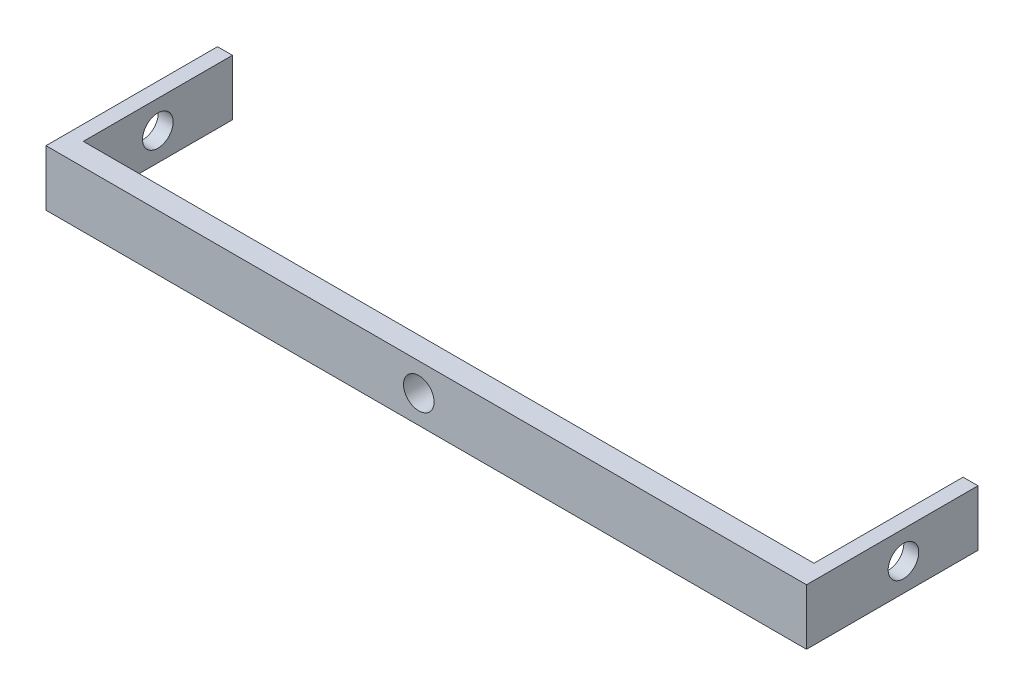
ISO-10303-21;
HEADER;
FILE_DESCRIPTION(('STEP AP214'),'2;1');
FILE_NAME('part.step','',(''),(''),'','','');
FILE_SCHEMA(('AUTOMOTIVE_DESIGN { 1 0 10303 214 1 1 1 1 }'));
ENDSEC;
DATA;
#1=APPLICATION_CONTEXT('core data for automotive mechanical design processes');
#2=APPLICATION_PROTOCOL_DEFINITION('international standard','automotive_design',2000,#1);
#3=PRODUCT_CONTEXT('',#1,'mechanical');
#4=PRODUCT('Part','Part','',(#3));
#5=PRODUCT_RELATED_PRODUCT_CATEGORY('part','',(#4));
#6=PRODUCT_DEFINITION_FORMATION('','',#4);
#7=PRODUCT_DEFINITION_CONTEXT('part definition',#1,'design');
#8=PRODUCT_DEFINITION('design','',#6,#7);
#9=PRODUCT_DEFINITION_SHAPE('','',#8);
#10=(LENGTH_UNIT() NAMED_UNIT(*) SI_UNIT(.MILLI.,.METRE.));
#11=(NAMED_UNIT(*) PLANE_ANGLE_UNIT() SI_UNIT($,.RADIAN.));
#12=(NAMED_UNIT(*) SI_UNIT($,.STERADIAN.) SOLID_ANGLE_UNIT());
#13=UNCERTAINTY_MEASURE_WITH_UNIT(LENGTH_MEASURE(1.E-05),#10,'distance_accuracy_value','');
#14=(GEOMETRIC_REPRESENTATION_CONTEXT(3) GLOBAL_UNCERTAINTY_ASSIGNED_CONTEXT((#13)) GLOBAL_UNIT_ASSIGNED_CONTEXT((#10,
#11,#12)) REPRESENTATION_CONTEXT('',''));
#15=CARTESIAN_POINT('',(0.,0.,0.));
#16=DIRECTION('',(0.,0.,1.));
#17=DIRECTION('',(1.,0.,0.));
#18=AXIS2_PLACEMENT_3D('',#15,#16,#17);
#19=CARTESIAN_POINT('',(-50.,-3.75000000000001,3.));
#20=DIRECTION('',(1.,0.,0.));
#21=DIRECTION('',(0.,0.,-1.));
#22=AXIS2_PLACEMENT_3D('',#19,#20,#21);
#23=PLANE('',#22);
#24=CARTESIAN_POINT('',(-50.,0.,-10.));
#25=DIRECTION('',(1.,0.,0.));
#26=DIRECTION('',(0.,0.,-1.));
#27=AXIS2_PLACEMENT_3D('',#24,#25,#26);
#28=CIRCLE('',#27,2.05000000000831);
#29=CARTESIAN_POINT('',(-50.,0.,-12.0500000000083));
#30=VERTEX_POINT('',#29);
#31=EDGE_CURVE('E207',#30,#30,#28,.T.);
#32=ORIENTED_EDGE('',*,*,#31,.T.);
#33=EDGE_LOOP('',(#32));
#34=FACE_BOUND('',#33,.T.);
#35=DIRECTION('',(0.,0.,-1.));
#36=VECTOR('',#35,1.);
#37=CARTESIAN_POINT('',(-50.,3.74999999999999,3.));
#38=LINE('',#37,#36);
#39=CARTESIAN_POINT('',(-50.,3.74999999999999,3.));
#40=VERTEX_POINT('',#39);
#41=CARTESIAN_POINT('',(-50.,3.75,-20.));
#42=VERTEX_POINT('',#41);
#43=EDGE_CURVE('E183',#40,#42,#38,.T.);
#44=ORIENTED_EDGE('',*,*,#43,.T.);
#45=DIRECTION('',(0.,1.,0.));
#46=VECTOR('',#45,1.);
#47=CARTESIAN_POINT('',(-50.,-3.75000000000001,-20.));
#48=LINE('',#47,#46);
#49=CARTESIAN_POINT('',(-50.,-3.75,-20.));
#50=VERTEX_POINT('',#49);
#51=EDGE_CURVE('E138',#50,#42,#48,.T.);
#52=ORIENTED_EDGE('',*,*,#51,.F.);
#53=DIRECTION('',(0.,0.,-1.));
#54=VECTOR('',#53,1.);
#55=CARTESIAN_POINT('',(-50.,-3.75000000000001,3.));
#56=LINE('',#55,#54);
#57=CARTESIAN_POINT('',(-50.,-3.75000000000001,3.));
#58=VERTEX_POINT('',#57);
#59=EDGE_CURVE('E53',#58,#50,#56,.T.);
#60=ORIENTED_EDGE('',*,*,#59,.F.);
#61=DIRECTION('',(0.,-1.,0.));
#62=VECTOR('',#61,1.);
#63=CARTESIAN_POINT('',(-50.,-3.75000000000001,3.));
#64=LINE('',#63,#62);
#65=EDGE_CURVE('E174',#40,#58,#64,.T.);
#66=ORIENTED_EDGE('',*,*,#65,.F.);
#67=EDGE_LOOP('',(#44,#52,#60,#66));
#68=FACE_BOUND('',#67,.T.);
#69=ADVANCED_FACE('F43',(#34,#68),#23,.F.);
#70=CARTESIAN_POINT('',(50.,-3.74999999999999,3.));
#71=DIRECTION('',(0.,1.,0.));
#72=DIRECTION('',(-1.,0.,0.));
#73=AXIS2_PLACEMENT_3D('',#70,#71,#72);
#74=PLANE('',#73);
#75=DIRECTION('',(0.,0.,-1.));
#76=VECTOR('',#75,1.);
#77=CARTESIAN_POINT('',(52.,-3.75,3.));
#78=LINE('',#77,#76);
#79=CARTESIAN_POINT('',(52.,-3.75,3.));
#80=VERTEX_POINT('',#79);
#81=CARTESIAN_POINT('',(52.,-3.75,-20.));
#82=VERTEX_POINT('',#81);
#83=EDGE_CURVE('E151',#80,#82,#78,.T.);
#84=ORIENTED_EDGE('',*,*,#83,.F.);
#85=DIRECTION('',(1.,0.,0.));
#86=VECTOR('',#85,1.);
#87=CARTESIAN_POINT('',(50.,-3.74999999999999,3.));
#88=LINE('',#87,#86);
#89=EDGE_CURVE('E177',#58,#80,#88,.T.);
#90=ORIENTED_EDGE('',*,*,#89,.F.);
#91=ORIENTED_EDGE('',*,*,#59,.T.);
#92=DIRECTION('',(-1.,0.,0.));
#93=VECTOR('',#92,1.);
#94=CARTESIAN_POINT('',(-48.,-3.75,-20.));
#95=LINE('',#94,#93);
#96=CARTESIAN_POINT('',(-48.,-3.75,-20.));
#97=VERTEX_POINT('',#96);
#98=EDGE_CURVE('E118',#97,#50,#95,.T.);
#99=ORIENTED_EDGE('',*,*,#98,.F.);
#100=DIRECTION('',(0.,0.,-1.));
#101=VECTOR('',#100,1.);
#102=CARTESIAN_POINT('',(-48.,-3.75,3.));
#103=LINE('',#102,#101);
#104=CARTESIAN_POINT('',(-48.,-3.75,0.));
#105=VERTEX_POINT('',#104);
#106=EDGE_CURVE('E105',#105,#97,#103,.T.);
#107=ORIENTED_EDGE('',*,*,#106,.F.);
#108=DIRECTION('',(1.,0.,0.));
#109=VECTOR('',#108,1.);
#110=CARTESIAN_POINT('',(50.,-3.74999999999999,0.));
#111=LINE('',#110,#109);
#112=CARTESIAN_POINT('',(50.,-3.74999999999999,0.));
#113=VERTEX_POINT('',#112);
#114=EDGE_CURVE('E173',#105,#113,#111,.T.);
#115=ORIENTED_EDGE('',*,*,#114,.T.);
#116=DIRECTION('',(0.,0.,-1.));
#117=VECTOR('',#116,1.);
#118=CARTESIAN_POINT('',(50.,-3.75,3.));
#119=LINE('',#118,#117);
#120=CARTESIAN_POINT('',(50.,-3.75,-20.));
#121=VERTEX_POINT('',#120);
#122=EDGE_CURVE('E161',#113,#121,#119,.T.);
#123=ORIENTED_EDGE('',*,*,#122,.T.);
#124=DIRECTION('',(-1.,0.,0.));
#125=VECTOR('',#124,1.);
#126=CARTESIAN_POINT('',(52.,-3.75,-20.));
#127=LINE('',#126,#125);
#128=EDGE_CURVE('E169',#82,#121,#127,.T.);
#129=ORIENTED_EDGE('',*,*,#128,.F.);
#130=EDGE_LOOP('',(#84,#90,#91,#99,#107,#115,#123,#129));
#131=FACE_BOUND('',#130,.T.);
#132=ADVANCED_FACE('F120',(#131),#74,.F.);
#133=CARTESIAN_POINT('',(50.,3.75000000000001,3.));
#134=DIRECTION('',(0.,-1.,0.));
#135=DIRECTION('',(1.,0.,0.));
#136=AXIS2_PLACEMENT_3D('',#133,#134,#135);
#137=PLANE('',#136);
#138=DIRECTION('',(-1.,0.,0.));
#139=VECTOR('',#138,1.);
#140=CARTESIAN_POINT('',(50.,3.75000000000001,0.));
#141=LINE('',#140,#139);
#142=CARTESIAN_POINT('',(50.,3.75,0.));
#143=VERTEX_POINT('',#142);
#144=CARTESIAN_POINT('',(-48.,3.75,0.));
#145=VERTEX_POINT('',#144);
#146=EDGE_CURVE('E178',#143,#145,#141,.T.);
#147=ORIENTED_EDGE('',*,*,#146,.T.);
#148=DIRECTION('',(0.,0.,1.));
#149=VECTOR('',#148,1.);
#150=CARTESIAN_POINT('',(-48.,3.75,3.));
#151=LINE('',#150,#149);
#152=CARTESIAN_POINT('',(-48.,3.75,-20.));
#153=VERTEX_POINT('',#152);
#154=EDGE_CURVE('E115',#153,#145,#151,.T.);
#155=ORIENTED_EDGE('',*,*,#154,.F.);
#156=DIRECTION('',(-1.,0.,0.));
#157=VECTOR('',#156,1.);
#158=CARTESIAN_POINT('',(-48.,3.75,-20.));
#159=LINE('',#158,#157);
#160=EDGE_CURVE('E127',#153,#42,#159,.T.);
#161=ORIENTED_EDGE('',*,*,#160,.T.);
#162=ORIENTED_EDGE('',*,*,#43,.F.);
#163=DIRECTION('',(-1.,0.,0.));
#164=VECTOR('',#163,1.);
#165=CARTESIAN_POINT('',(50.,3.75000000000001,3.));
#166=LINE('',#165,#164);
#167=CARTESIAN_POINT('',(52.,3.75,3.));
#168=VERTEX_POINT('',#167);
#169=EDGE_CURVE('E61',#168,#40,#166,.T.);
#170=ORIENTED_EDGE('',*,*,#169,.F.);
#171=DIRECTION('',(0.,0.,1.));
#172=VECTOR('',#171,1.);
#173=CARTESIAN_POINT('',(52.,3.75,3.));
#174=LINE('',#173,#172);
#175=CARTESIAN_POINT('',(52.,3.75,-20.));
#176=VERTEX_POINT('',#175);
#177=EDGE_CURVE('E142',#176,#168,#174,.T.);
#178=ORIENTED_EDGE('',*,*,#177,.F.);
#179=DIRECTION('',(-1.,0.,0.));
#180=VECTOR('',#179,1.);
#181=CARTESIAN_POINT('',(52.,3.75,-20.));
#182=LINE('',#181,#180);
#183=CARTESIAN_POINT('',(50.,3.75,-20.));
#184=VERTEX_POINT('',#183);
#185=EDGE_CURVE('E157',#176,#184,#182,.T.);
#186=ORIENTED_EDGE('',*,*,#185,.T.);
#187=DIRECTION('',(0.,0.,1.));
#188=VECTOR('',#187,1.);
#189=CARTESIAN_POINT('',(50.,3.75,3.));
#190=LINE('',#189,#188);
#191=EDGE_CURVE('E126',#184,#143,#190,.T.);
#192=ORIENTED_EDGE('',*,*,#191,.T.);
#193=EDGE_LOOP('',(#147,#155,#161,#162,#170,#178,#186,#192));
#194=FACE_BOUND('',#193,.T.);
#195=ADVANCED_FACE('F221',(#194),#137,.F.);
#196=CARTESIAN_POINT('',(0.,0.,3.));
#197=DIRECTION('',(0.,0.,1.));
#198=DIRECTION('',(1.,0.,0.));
#199=AXIS2_PLACEMENT_3D('',#196,#197,#198);
#200=PLANE('',#199);
#201=CARTESIAN_POINT('',(0.,0.,3.));
#202=DIRECTION('',(0.,0.,1.));
#203=DIRECTION('',(1.,0.,0.));
#204=AXIS2_PLACEMENT_3D('',#201,#202,#203);
#205=CIRCLE('',#204,2.05);
#206=CARTESIAN_POINT('',(2.05,0.,3.));
#207=VERTEX_POINT('',#206);
#208=EDGE_CURVE('E215',#207,#207,#205,.T.);
#209=ORIENTED_EDGE('',*,*,#208,.F.);
#210=EDGE_LOOP('',(#209));
#211=FACE_BOUND('',#210,.T.);
#212=ORIENTED_EDGE('',*,*,#169,.T.);
#213=ORIENTED_EDGE('',*,*,#65,.T.);
#214=ORIENTED_EDGE('',*,*,#89,.T.);
#215=DIRECTION('',(0.,-1.,0.));
#216=VECTOR('',#215,1.);
#217=CARTESIAN_POINT('',(52.,-3.74999999999999,3.));
#218=LINE('',#217,#216);
#219=EDGE_CURVE('E146',#168,#80,#218,.T.);
#220=ORIENTED_EDGE('',*,*,#219,.F.);
#221=EDGE_LOOP('',(#212,#213,#214,#220));
#222=FACE_BOUND('',#221,.T.);
#223=ADVANCED_FACE('F236',(#211,#222),#200,.T.);
#224=CARTESIAN_POINT('',(0.,0.,0.));
#225=DIRECTION('',(0.,0.,1.));
#226=DIRECTION('',(1.,0.,0.));
#227=AXIS2_PLACEMENT_3D('',#224,#225,#226);
#228=PLANE('',#227);
#229=CARTESIAN_POINT('',(0.,0.,0.));
#230=DIRECTION('',(0.,0.,1.));
#231=DIRECTION('',(1.,0.,0.));
#232=AXIS2_PLACEMENT_3D('',#229,#230,#231);
#233=CIRCLE('',#232,2.05);
#234=CARTESIAN_POINT('',(2.05,0.,0.));
#235=VERTEX_POINT('',#234);
#236=EDGE_CURVE('E46',#235,#235,#233,.T.);
#237=ORIENTED_EDGE('',*,*,#236,.T.);
#238=EDGE_LOOP('',(#237));
#239=FACE_BOUND('',#238,.T.);
#240=ORIENTED_EDGE('',*,*,#114,.F.);
#241=DIRECTION('',(0.,1.,0.));
#242=VECTOR('',#241,1.);
#243=CARTESIAN_POINT('',(-48.,0.,0.));
#244=LINE('',#243,#242);
#245=EDGE_CURVE('E11',#105,#145,#244,.T.);
#246=ORIENTED_EDGE('',*,*,#245,.T.);
#247=ORIENTED_EDGE('',*,*,#146,.F.);
#248=DIRECTION('',(0.,1.,0.));
#249=VECTOR('',#248,1.);
#250=CARTESIAN_POINT('',(50.,-3.74999999999999,0.));
#251=LINE('',#250,#249);
#252=EDGE_CURVE('E186',#113,#143,#251,.T.);
#253=ORIENTED_EDGE('',*,*,#252,.F.);
#254=EDGE_LOOP('',(#240,#246,#247,#253));
#255=FACE_BOUND('',#254,.T.);
#256=ADVANCED_FACE('F219',(#239,#255),#228,.F.);
#257=CARTESIAN_POINT('',(50.,0.,0.));
#258=DIRECTION('',(1.,0.,0.));
#259=DIRECTION('',(0.,0.,-1.));
#260=AXIS2_PLACEMENT_3D('',#257,#258,#259);
#261=PLANE('',#260);
#262=CARTESIAN_POINT('',(50.,0.,-10.));
#263=DIRECTION('',(1.,0.,0.));
#264=DIRECTION('',(0.,0.,-1.));
#265=AXIS2_PLACEMENT_3D('',#262,#263,#264);
#266=CIRCLE('',#265,2.05000000000831);
#267=CARTESIAN_POINT('',(50.,0.,-12.0500000000083));
#268=VERTEX_POINT('',#267);
#269=EDGE_CURVE('E140',#268,#268,#266,.F.);
#270=ORIENTED_EDGE('',*,*,#269,.F.);
#271=EDGE_LOOP('',(#270));
#272=FACE_BOUND('',#271,.T.);
#273=ORIENTED_EDGE('',*,*,#122,.F.);
#274=ORIENTED_EDGE('',*,*,#252,.T.);
#275=ORIENTED_EDGE('',*,*,#191,.F.);
#276=DIRECTION('',(0.,1.,0.));
#277=VECTOR('',#276,1.);
#278=CARTESIAN_POINT('',(50.,-3.74999999999999,-20.));
#279=LINE('',#278,#277);
#280=EDGE_CURVE('E147',#121,#184,#279,.T.);
#281=ORIENTED_EDGE('',*,*,#280,.F.);
#282=EDGE_LOOP('',(#273,#274,#275,#281));
#283=FACE_BOUND('',#282,.T.);
#284=ADVANCED_FACE('F228',(#272,#283),#261,.F.);
#285=CARTESIAN_POINT('',(52.,-3.74999999999999,-20.));
#286=DIRECTION('',(0.,0.,1.));
#287=DIRECTION('',(1.,0.,0.));
#288=AXIS2_PLACEMENT_3D('',#285,#286,#287);
#289=PLANE('',#288);
#290=ORIENTED_EDGE('',*,*,#280,.T.);
#291=ORIENTED_EDGE('',*,*,#185,.F.);
#292=DIRECTION('',(0.,1.,0.));
#293=VECTOR('',#292,1.);
#294=CARTESIAN_POINT('',(52.,-3.74999999999999,-20.));
#295=LINE('',#294,#293);
#296=EDGE_CURVE('E154',#82,#176,#295,.T.);
#297=ORIENTED_EDGE('',*,*,#296,.F.);
#298=ORIENTED_EDGE('',*,*,#128,.T.);
#299=EDGE_LOOP('',(#290,#291,#297,#298));
#300=FACE_BOUND('',#299,.T.);
#301=ADVANCED_FACE('F232',(#300),#289,.F.);
#302=CARTESIAN_POINT('',(52.,0.,0.));
#303=DIRECTION('',(1.,0.,0.));
#304=DIRECTION('',(0.,0.,-1.));
#305=AXIS2_PLACEMENT_3D('',#302,#303,#304);
#306=PLANE('',#305);
#307=CARTESIAN_POINT('',(52.,0.,-10.));
#308=DIRECTION('',(1.,0.,0.));
#309=DIRECTION('',(0.,0.,-1.));
#310=AXIS2_PLACEMENT_3D('',#307,#308,#309);
#311=CIRCLE('',#310,2.05000000000831);
#312=CARTESIAN_POINT('',(52.,0.,-12.0500000000083));
#313=VERTEX_POINT('',#312);
#314=EDGE_CURVE('E199',#313,#313,#311,.T.);
#315=ORIENTED_EDGE('',*,*,#314,.F.);
#316=EDGE_LOOP('',(#315));
#317=FACE_BOUND('',#316,.T.);
#318=ORIENTED_EDGE('',*,*,#177,.T.);
#319=ORIENTED_EDGE('',*,*,#219,.T.);
#320=ORIENTED_EDGE('',*,*,#83,.T.);
#321=ORIENTED_EDGE('',*,*,#296,.T.);
#322=EDGE_LOOP('',(#318,#319,#320,#321));
#323=FACE_BOUND('',#322,.T.);
#324=ADVANCED_FACE('F234',(#317,#323),#306,.T.);
#325=CARTESIAN_POINT('',(-48.,0.,0.));
#326=DIRECTION('',(1.,0.,0.));
#327=DIRECTION('',(0.,0.,-1.));
#328=AXIS2_PLACEMENT_3D('',#325,#326,#327);
#329=PLANE('',#328);
#330=CARTESIAN_POINT('',(-48.,0.,-10.));
#331=DIRECTION('',(1.,0.,0.));
#332=DIRECTION('',(0.,0.,-1.));
#333=AXIS2_PLACEMENT_3D('',#330,#331,#332);
#334=CIRCLE('',#333,2.05000000000831);
#335=CARTESIAN_POINT('',(-48.,0.,-12.0500000000083));
#336=VERTEX_POINT('',#335);
#337=EDGE_CURVE('E196',#336,#336,#334,.F.);
#338=ORIENTED_EDGE('',*,*,#337,.T.);
#339=EDGE_LOOP('',(#338));
#340=FACE_BOUND('',#339,.T.);
#341=ORIENTED_EDGE('',*,*,#245,.F.);
#342=ORIENTED_EDGE('',*,*,#106,.T.);
#343=DIRECTION('',(0.,1.,0.));
#344=VECTOR('',#343,1.);
#345=CARTESIAN_POINT('',(-48.,-3.75000000000001,-20.));
#346=LINE('',#345,#344);
#347=EDGE_CURVE('E109',#97,#153,#346,.T.);
#348=ORIENTED_EDGE('',*,*,#347,.T.);
#349=ORIENTED_EDGE('',*,*,#154,.T.);
#350=EDGE_LOOP('',(#341,#342,#348,#349));
#351=FACE_BOUND('',#350,.T.);
#352=ADVANCED_FACE('F107',(#340,#351),#329,.T.);
#353=CARTESIAN_POINT('',(-48.,-3.75000000000001,-20.));
#354=DIRECTION('',(0.,0.,1.));
#355=DIRECTION('',(1.,0.,0.));
#356=AXIS2_PLACEMENT_3D('',#353,#354,#355);
#357=PLANE('',#356);
#358=ORIENTED_EDGE('',*,*,#51,.T.);
#359=ORIENTED_EDGE('',*,*,#160,.F.);
#360=ORIENTED_EDGE('',*,*,#347,.F.);
#361=ORIENTED_EDGE('',*,*,#98,.T.);
#362=EDGE_LOOP('',(#358,#359,#360,#361));
#363=FACE_BOUND('',#362,.T.);
#364=ADVANCED_FACE('F129',(#363),#357,.F.);
#365=CARTESIAN_POINT('',(52.,0.,-10.));
#366=DIRECTION('',(-1.,0.,0.));
#367=DIRECTION('',(0.,0.,1.));
#368=AXIS2_PLACEMENT_3D('',#365,#366,#367);
#369=CYLINDRICAL_SURFACE('',#368,2.05000000000831);
#370=ORIENTED_EDGE('',*,*,#337,.F.);
#371=EDGE_LOOP('',(#370));
#372=FACE_BOUND('',#371,.T.);
#373=ORIENTED_EDGE('',*,*,#31,.F.);
#374=EDGE_LOOP('',(#373));
#375=FACE_BOUND('',#374,.T.);
#376=ADVANCED_FACE('F245',(#372,#375),#369,.F.);
#377=ORIENTED_EDGE('',*,*,#314,.T.);
#378=EDGE_LOOP('',(#377));
#379=FACE_BOUND('',#378,.T.);
#380=ORIENTED_EDGE('',*,*,#269,.T.);
#381=EDGE_LOOP('',(#380));
#382=FACE_BOUND('',#381,.T.);
#383=ADVANCED_FACE('F247',(#379,#382),#369,.F.);
#384=CARTESIAN_POINT('',(0.,0.,-20.));
#385=DIRECTION('',(0.,0.,1.));
#386=DIRECTION('',(1.,0.,0.));
#387=AXIS2_PLACEMENT_3D('',#384,#385,#386);
#388=CYLINDRICAL_SURFACE('',#387,2.05);
#389=ORIENTED_EDGE('',*,*,#208,.T.);
#390=EDGE_LOOP('',(#389));
#391=FACE_BOUND('',#390,.T.);
#392=ORIENTED_EDGE('',*,*,#236,.F.);
#393=EDGE_LOOP('',(#392));
#394=FACE_BOUND('',#393,.T.);
#395=ADVANCED_FACE('F254',(#391,#394),#388,.F.);
#396=CLOSED_SHELL('',(#69,#132,#195,#223,#256,#284,#301,#324,#352,#364,#376,#383,#395));
#397=MANIFOLD_SOLID_BREP('B2',#396);
#398=ADVANCED_BREP_SHAPE_REPRESENTATION('',(#18,#397),#14);
#399=SHAPE_DEFINITION_REPRESENTATION(#9,#398);
ENDSEC;
END-ISO-10303-21;
